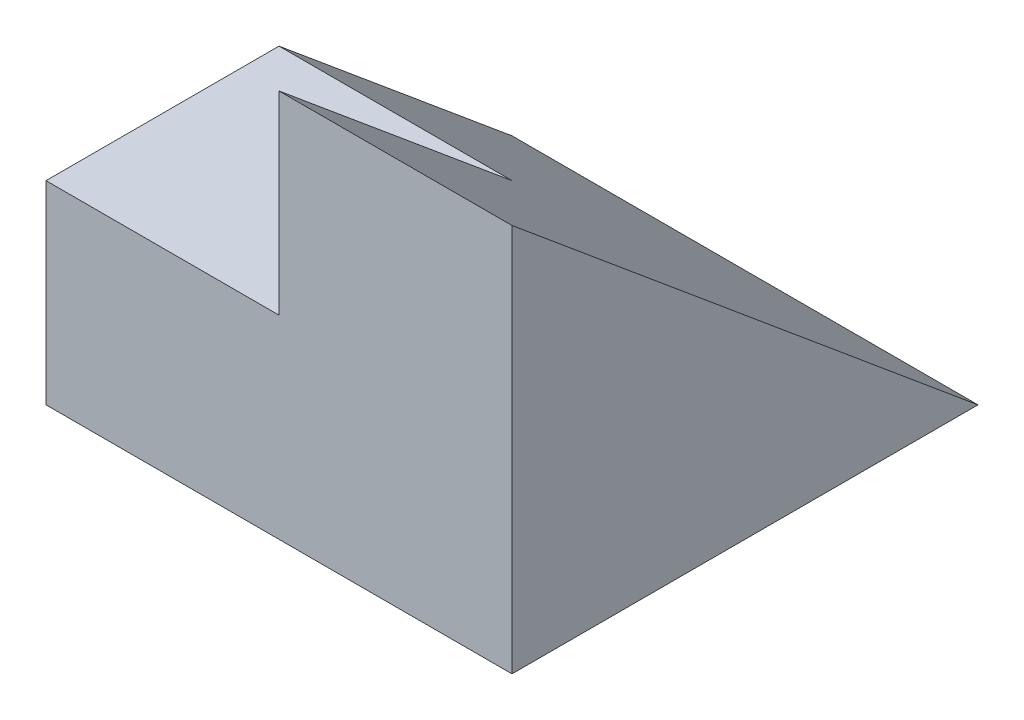
ISO-10303-21;
HEADER;
FILE_DESCRIPTION(('STEP AP214'),'2;1');
FILE_NAME('part.step','',(''),(''),'','','');
FILE_SCHEMA(('AUTOMOTIVE_DESIGN { 1 0 10303 214 1 1 1 1 }'));
ENDSEC;
DATA;
#1=APPLICATION_CONTEXT('core data for automotive mechanical design processes');
#2=APPLICATION_PROTOCOL_DEFINITION('international standard','automotive_design',2000,#1);
#3=PRODUCT_CONTEXT('',#1,'mechanical');
#4=PRODUCT('Part','Part','',(#3));
#5=PRODUCT_RELATED_PRODUCT_CATEGORY('part','',(#4));
#6=PRODUCT_DEFINITION_FORMATION('','',#4);
#7=PRODUCT_DEFINITION_CONTEXT('part definition',#1,'design');
#8=PRODUCT_DEFINITION('design','',#6,#7);
#9=PRODUCT_DEFINITION_SHAPE('','',#8);
#10=(LENGTH_UNIT() NAMED_UNIT(*) SI_UNIT(.MILLI.,.METRE.));
#11=(NAMED_UNIT(*) PLANE_ANGLE_UNIT() SI_UNIT($,.RADIAN.));
#12=(NAMED_UNIT(*) SI_UNIT($,.STERADIAN.) SOLID_ANGLE_UNIT());
#13=UNCERTAINTY_MEASURE_WITH_UNIT(LENGTH_MEASURE(1.E-05),#10,'distance_accuracy_value','');
#14=(GEOMETRIC_REPRESENTATION_CONTEXT(3) GLOBAL_UNCERTAINTY_ASSIGNED_CONTEXT((#13)) GLOBAL_UNIT_ASSIGNED_CONTEXT((#10,
#11,#12)) REPRESENTATION_CONTEXT('',''));
#15=CARTESIAN_POINT('',(0.,0.,0.));
#16=DIRECTION('',(0.,0.,1.));
#17=DIRECTION('',(1.,0.,0.));
#18=AXIS2_PLACEMENT_3D('',#15,#16,#17);
#19=CARTESIAN_POINT('',(3.,5.,3.));
#20=DIRECTION('',(-1.,0.,0.));
#21=DIRECTION('',(0.,0.,1.));
#22=AXIS2_PLACEMENT_3D('',#19,#20,#21);
#23=PLANE('',#22);
#24=DIRECTION('',(0.,0.,-1.));
#25=VECTOR('',#24,1.);
#26=CARTESIAN_POINT('',(3.,0.,3.));
#27=LINE('',#26,#25);
#28=CARTESIAN_POINT('',(3.,0.,3.));
#29=VERTEX_POINT('',#28);
#30=CARTESIAN_POINT('',(3.,0.,-3.));
#31=VERTEX_POINT('',#30);
#32=EDGE_CURVE('E106',#29,#31,#27,.T.);
#33=ORIENTED_EDGE('',*,*,#32,.T.);
#34=DIRECTION('',(0.,0.64018439966448,0.768221279597376));
#35=VECTOR('',#34,1.);
#36=CARTESIAN_POINT('',(3.,5.,3.));
#37=LINE('',#36,#35);
#38=CARTESIAN_POINT('',(3.,5.,3.));
#39=VERTEX_POINT('',#38);
#40=EDGE_CURVE('E103',#31,#39,#37,.T.);
#41=ORIENTED_EDGE('',*,*,#40,.T.);
#42=DIRECTION('',(0.,-1.,0.));
#43=VECTOR('',#42,1.);
#44=CARTESIAN_POINT('',(3.,5.,3.));
#45=LINE('',#44,#43);
#46=EDGE_CURVE('E40',#39,#29,#45,.T.);
#47=ORIENTED_EDGE('',*,*,#46,.T.);
#48=EDGE_LOOP('',(#33,#41,#47));
#49=FACE_BOUND('',#48,.T.);
#50=ADVANCED_FACE('F33',(#49),#23,.F.);
#51=CARTESIAN_POINT('',(-3.,5.,3.));
#52=DIRECTION('',(1.,0.,0.));
#53=DIRECTION('',(0.,0.,-1.));
#54=AXIS2_PLACEMENT_3D('',#51,#52,#53);
#55=PLANE('',#54);
#56=DIRECTION('',(0.,-1.,0.));
#57=VECTOR('',#56,1.);
#58=CARTESIAN_POINT('',(-3.,5.,3.));
#59=LINE('',#58,#57);
#60=CARTESIAN_POINT('',(-3.,2.5,3.));
#61=VERTEX_POINT('',#60);
#62=CARTESIAN_POINT('',(-3.,0.,3.));
#63=VERTEX_POINT('',#62);
#64=EDGE_CURVE('E11',#61,#63,#59,.T.);
#65=ORIENTED_EDGE('',*,*,#64,.F.);
#66=DIRECTION('',(0.,0.,1.));
#67=VECTOR('',#66,1.);
#68=CARTESIAN_POINT('',(-3.,2.5,0.));
#69=LINE('',#68,#67);
#70=CARTESIAN_POINT('',(-3.,2.5,0.));
#71=VERTEX_POINT('',#70);
#72=EDGE_CURVE('E91',#71,#61,#69,.T.);
#73=ORIENTED_EDGE('',*,*,#72,.F.);
#74=DIRECTION('',(0.,0.64018439966448,0.768221279597376));
#75=VECTOR('',#74,1.);
#76=CARTESIAN_POINT('',(-3.,1.47540983606557,-1.22950819672131));
#77=LINE('',#76,#75);
#78=CARTESIAN_POINT('',(-3.,0.,-3.));
#79=VERTEX_POINT('',#78);
#80=EDGE_CURVE('E96',#79,#71,#77,.T.);
#81=ORIENTED_EDGE('',*,*,#80,.F.);
#82=DIRECTION('',(0.,0.,1.));
#83=VECTOR('',#82,1.);
#84=CARTESIAN_POINT('',(-3.,0.,3.));
#85=LINE('',#84,#83);
#86=EDGE_CURVE('E113',#79,#63,#85,.T.);
#87=ORIENTED_EDGE('',*,*,#86,.T.);
#88=EDGE_LOOP('',(#65,#73,#81,#87));
#89=FACE_BOUND('',#88,.T.);
#90=ADVANCED_FACE('F124',(#89),#55,.F.);
#91=CARTESIAN_POINT('',(-3.,5.,3.));
#92=DIRECTION('',(0.,0.,-1.));
#93=DIRECTION('',(-1.,0.,0.));
#94=AXIS2_PLACEMENT_3D('',#91,#92,#93);
#95=PLANE('',#94);
#96=DIRECTION('',(0.,1.,0.));
#97=VECTOR('',#96,1.);
#98=CARTESIAN_POINT('',(0.,0.,3.));
#99=LINE('',#98,#97);
#100=CARTESIAN_POINT('',(0.,2.5,3.));
#101=VERTEX_POINT('',#100);
#102=CARTESIAN_POINT('',(0.,5.,3.));
#103=VERTEX_POINT('',#102);
#104=EDGE_CURVE('E47',#101,#103,#99,.T.);
#105=ORIENTED_EDGE('',*,*,#104,.F.);
#106=DIRECTION('',(-1.,0.,0.));
#107=VECTOR('',#106,1.);
#108=CARTESIAN_POINT('',(0.,2.5,3.));
#109=LINE('',#108,#107);
#110=EDGE_CURVE('E85',#101,#61,#109,.T.);
#111=ORIENTED_EDGE('',*,*,#110,.T.);
#112=ORIENTED_EDGE('',*,*,#64,.T.);
#113=DIRECTION('',(1.,0.,0.));
#114=VECTOR('',#113,1.);
#115=CARTESIAN_POINT('',(-3.,0.,3.));
#116=LINE('',#115,#114);
#117=EDGE_CURVE('E54',#63,#29,#116,.T.);
#118=ORIENTED_EDGE('',*,*,#117,.T.);
#119=ORIENTED_EDGE('',*,*,#46,.F.);
#120=DIRECTION('',(1.,0.,0.));
#121=VECTOR('',#120,1.);
#122=CARTESIAN_POINT('',(-3.,5.,3.));
#123=LINE('',#122,#121);
#124=EDGE_CURVE('E107',#103,#39,#123,.T.);
#125=ORIENTED_EDGE('',*,*,#124,.F.);
#126=EDGE_LOOP('',(#105,#111,#112,#118,#119,#125));
#127=FACE_BOUND('',#126,.T.);
#128=ADVANCED_FACE('F125',(#127),#95,.F.);
#129=CARTESIAN_POINT('',(0.,0.,0.));
#130=DIRECTION('',(0.,-1.,0.));
#131=DIRECTION('',(0.,0.,-1.));
#132=AXIS2_PLACEMENT_3D('',#129,#130,#131);
#133=PLANE('',#132);
#134=ORIENTED_EDGE('',*,*,#32,.F.);
#135=ORIENTED_EDGE('',*,*,#117,.F.);
#136=ORIENTED_EDGE('',*,*,#86,.F.);
#137=DIRECTION('',(-1.,0.,0.));
#138=VECTOR('',#137,1.);
#139=CARTESIAN_POINT('',(-3.,0.,-3.));
#140=LINE('',#139,#138);
#141=EDGE_CURVE('E111',#31,#79,#140,.T.);
#142=ORIENTED_EDGE('',*,*,#141,.F.);
#143=EDGE_LOOP('',(#134,#135,#136,#142));
#144=FACE_BOUND('',#143,.T.);
#145=ADVANCED_FACE('F120',(#144),#133,.T.);
#146=CARTESIAN_POINT('',(20.5,1.47540983606557,-1.22950819672131));
#147=DIRECTION('',(0.,-0.768221279597376,0.64018439966448));
#148=DIRECTION('',(0.,-0.64018439966448,-0.768221279597376));
#149=AXIS2_PLACEMENT_3D('',#146,#147,#148);
#150=PLANE('',#149);
#151=ORIENTED_EDGE('',*,*,#80,.T.);
#152=DIRECTION('',(-1.,0.,0.));
#153=VECTOR('',#152,1.);
#154=CARTESIAN_POINT('',(0.,2.5,0.));
#155=LINE('',#154,#153);
#156=CARTESIAN_POINT('',(0.,2.5,0.));
#157=VERTEX_POINT('',#156);
#158=EDGE_CURVE('E82',#157,#71,#155,.T.);
#159=ORIENTED_EDGE('',*,*,#158,.F.);
#160=DIRECTION('',(0.,-0.64018439966448,-0.768221279597376));
#161=VECTOR('',#160,1.);
#162=CARTESIAN_POINT('',(0.,1.47540983606557,-1.22950819672131));
#163=LINE('',#162,#161);
#164=EDGE_CURVE('E86',#103,#157,#163,.T.);
#165=ORIENTED_EDGE('',*,*,#164,.F.);
#166=ORIENTED_EDGE('',*,*,#124,.T.);
#167=ORIENTED_EDGE('',*,*,#40,.F.);
#168=ORIENTED_EDGE('',*,*,#141,.T.);
#169=EDGE_LOOP('',(#151,#159,#165,#166,#167,#168));
#170=FACE_BOUND('',#169,.T.);
#171=ADVANCED_FACE('F94',(#170),#150,.F.);
#172=CARTESIAN_POINT('',(0.,2.5,0.));
#173=DIRECTION('',(0.,-1.,0.));
#174=DIRECTION('',(0.,0.,-1.));
#175=AXIS2_PLACEMENT_3D('',#172,#173,#174);
#176=PLANE('',#175);
#177=ORIENTED_EDGE('',*,*,#72,.T.);
#178=ORIENTED_EDGE('',*,*,#110,.F.);
#179=DIRECTION('',(0.,0.,1.));
#180=VECTOR('',#179,1.);
#181=CARTESIAN_POINT('',(0.,2.5,0.));
#182=LINE('',#181,#180);
#183=EDGE_CURVE('E79',#157,#101,#182,.T.);
#184=ORIENTED_EDGE('',*,*,#183,.F.);
#185=ORIENTED_EDGE('',*,*,#158,.T.);
#186=EDGE_LOOP('',(#177,#178,#184,#185));
#187=FACE_BOUND('',#186,.T.);
#188=ADVANCED_FACE('F80',(#187),#176,.F.);
#189=CARTESIAN_POINT('',(0.,0.,0.));
#190=DIRECTION('',(-1.,0.,0.));
#191=DIRECTION('',(0.,0.,1.));
#192=AXIS2_PLACEMENT_3D('',#189,#190,#191);
#193=PLANE('',#192);
#194=ORIENTED_EDGE('',*,*,#164,.T.);
#195=ORIENTED_EDGE('',*,*,#183,.T.);
#196=ORIENTED_EDGE('',*,*,#104,.T.);
#197=EDGE_LOOP('',(#194,#195,#196));
#198=FACE_BOUND('',#197,.T.);
#199=ADVANCED_FACE('F88',(#198),#193,.T.);
#200=CLOSED_SHELL('',(#50,#90,#128,#145,#171,#188,#199));
#201=MANIFOLD_SOLID_BREP('B2',#200);
#202=ADVANCED_BREP_SHAPE_REPRESENTATION('',(#18,#201),#14);
#203=SHAPE_DEFINITION_REPRESENTATION(#9,#202);
ENDSEC;
END-ISO-10303-21;
